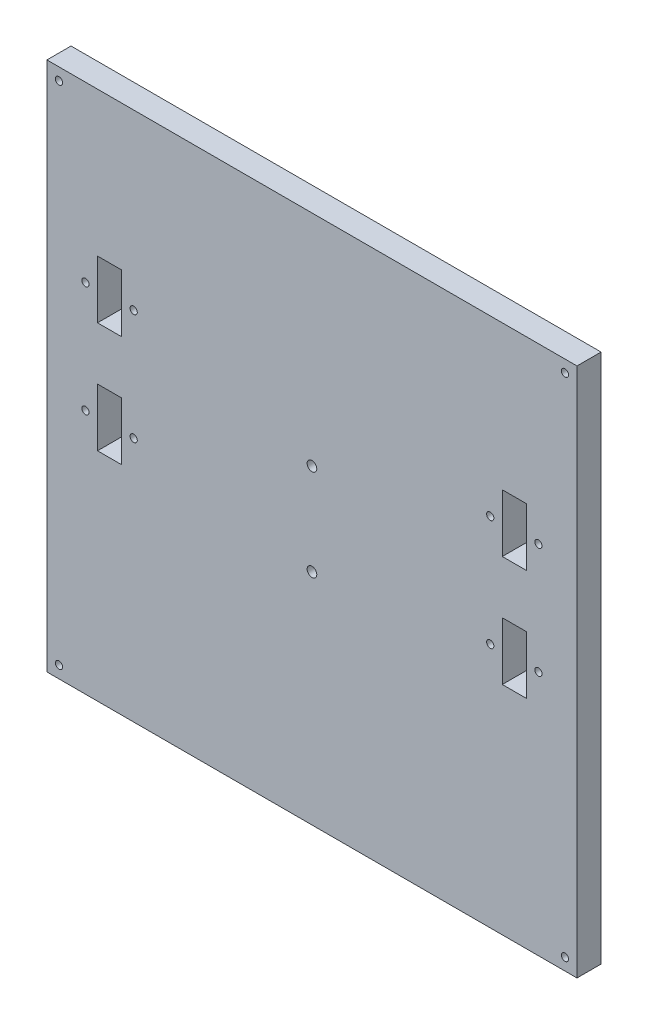
ISO-10303-21;
HEADER;
FILE_DESCRIPTION(('STEP AP214'),'2;1');
FILE_NAME('part.step','',(''),(''),'','','');
FILE_SCHEMA(('AUTOMOTIVE_DESIGN { 1 0 10303 214 1 1 1 1 }'));
ENDSEC;
DATA;
#1=APPLICATION_CONTEXT('core data for automotive mechanical design processes');
#2=APPLICATION_PROTOCOL_DEFINITION('international standard','automotive_design',2000,#1);
#3=PRODUCT_CONTEXT('',#1,'mechanical');
#4=PRODUCT('Part','Part','',(#3));
#5=PRODUCT_RELATED_PRODUCT_CATEGORY('part','',(#4));
#6=PRODUCT_DEFINITION_FORMATION('','',#4);
#7=PRODUCT_DEFINITION_CONTEXT('part definition',#1,'design');
#8=PRODUCT_DEFINITION('design','',#6,#7);
#9=PRODUCT_DEFINITION_SHAPE('','',#8);
#10=(LENGTH_UNIT() NAMED_UNIT(*) SI_UNIT(.MILLI.,.METRE.));
#11=(NAMED_UNIT(*) PLANE_ANGLE_UNIT() SI_UNIT($,.RADIAN.));
#12=(NAMED_UNIT(*) SI_UNIT($,.STERADIAN.) SOLID_ANGLE_UNIT());
#13=UNCERTAINTY_MEASURE_WITH_UNIT(LENGTH_MEASURE(1.E-05),#10,'distance_accuracy_value','');
#14=(GEOMETRIC_REPRESENTATION_CONTEXT(3) GLOBAL_UNCERTAINTY_ASSIGNED_CONTEXT((#13)) GLOBAL_UNIT_ASSIGNED_CONTEXT((#10,
#11,#12)) REPRESENTATION_CONTEXT('',''));
#15=CARTESIAN_POINT('',(0.,0.,0.));
#16=DIRECTION('',(0.,0.,1.));
#17=DIRECTION('',(1.,0.,0.));
#18=AXIS2_PLACEMENT_3D('',#15,#16,#17);
#19=CARTESIAN_POINT('',(112.522330276901,130.812483699006,10.));
#20=DIRECTION('',(1.,0.,0.));
#21=DIRECTION('',(0.,0.,-1.));
#22=AXIS2_PLACEMENT_3D('',#19,#20,#21);
#23=PLANE('',#22);
#24=DIRECTION('',(0.,-1.,0.));
#25=VECTOR('',#24,1.);
#26=CARTESIAN_POINT('',(112.522330276901,130.812483699006,0.));
#27=LINE('',#26,#25);
#28=CARTESIAN_POINT('',(112.522330276901,130.812483699006,0.));
#29=VERTEX_POINT('',#28);
#30=CARTESIAN_POINT('',(112.522330276901,-89.1875163009939,0.));
#31=VERTEX_POINT('',#30);
#32=EDGE_CURVE('E345',#29,#31,#27,.T.);
#33=ORIENTED_EDGE('',*,*,#32,.T.);
#34=DIRECTION('',(0.,0.,-1.));
#35=VECTOR('',#34,1.);
#36=CARTESIAN_POINT('',(112.522330276901,-89.1875163009939,10.));
#37=LINE('',#36,#35);
#38=CARTESIAN_POINT('',(112.522330276901,-89.1875163009939,10.));
#39=VERTEX_POINT('',#38);
#40=EDGE_CURVE('E11',#39,#31,#37,.T.);
#41=ORIENTED_EDGE('',*,*,#40,.F.);
#42=DIRECTION('',(0.,-1.,0.));
#43=VECTOR('',#42,1.);
#44=CARTESIAN_POINT('',(112.522330276901,130.812483699006,10.));
#45=LINE('',#44,#43);
#46=CARTESIAN_POINT('',(112.522330276901,130.812483699006,10.));
#47=VERTEX_POINT('',#46);
#48=EDGE_CURVE('E348',#47,#39,#45,.T.);
#49=ORIENTED_EDGE('',*,*,#48,.F.);
#50=DIRECTION('',(0.,0.,-1.));
#51=VECTOR('',#50,1.);
#52=CARTESIAN_POINT('',(112.522330276901,130.812483699006,10.));
#53=LINE('',#52,#51);
#54=EDGE_CURVE('E358',#47,#29,#53,.T.);
#55=ORIENTED_EDGE('',*,*,#54,.T.);
#56=EDGE_LOOP('',(#33,#41,#49,#55));
#57=FACE_BOUND('',#56,.T.);
#58=ADVANCED_FACE('F32',(#57),#23,.F.);
#59=CARTESIAN_POINT('',(112.522330276901,-89.1875163009939,10.));
#60=DIRECTION('',(0.,1.,0.));
#61=DIRECTION('',(0.,0.,1.));
#62=AXIS2_PLACEMENT_3D('',#59,#60,#61);
#63=PLANE('',#62);
#64=DIRECTION('',(1.,0.,0.));
#65=VECTOR('',#64,1.);
#66=CARTESIAN_POINT('',(112.522330276901,-89.1875163009939,0.));
#67=LINE('',#66,#65);
#68=CARTESIAN_POINT('',(332.522330276901,-89.1875163009939,0.));
#69=VERTEX_POINT('',#68);
#70=EDGE_CURVE('E361',#31,#69,#67,.T.);
#71=ORIENTED_EDGE('',*,*,#70,.T.);
#72=DIRECTION('',(0.,0.,-1.));
#73=VECTOR('',#72,1.);
#74=CARTESIAN_POINT('',(332.522330276901,-89.1875163009939,10.));
#75=LINE('',#74,#73);
#76=CARTESIAN_POINT('',(332.522330276901,-89.1875163009939,10.));
#77=VERTEX_POINT('',#76);
#78=EDGE_CURVE('E39',#77,#69,#75,.T.);
#79=ORIENTED_EDGE('',*,*,#78,.F.);
#80=DIRECTION('',(1.,0.,0.));
#81=VECTOR('',#80,1.);
#82=CARTESIAN_POINT('',(112.522330276901,-89.1875163009939,10.));
#83=LINE('',#82,#81);
#84=EDGE_CURVE('E351',#39,#77,#83,.T.);
#85=ORIENTED_EDGE('',*,*,#84,.F.);
#86=ORIENTED_EDGE('',*,*,#40,.T.);
#87=EDGE_LOOP('',(#71,#79,#85,#86));
#88=FACE_BOUND('',#87,.T.);
#89=ADVANCED_FACE('F390',(#88),#63,.F.);
#90=CARTESIAN_POINT('',(332.522330276901,130.812483699006,10.));
#91=DIRECTION('',(-1.,0.,0.));
#92=DIRECTION('',(0.,-1.,0.));
#93=AXIS2_PLACEMENT_3D('',#90,#91,#92);
#94=PLANE('',#93);
#95=DIRECTION('',(0.,1.,0.));
#96=VECTOR('',#95,1.);
#97=CARTESIAN_POINT('',(332.522330276901,130.812483699006,0.));
#98=LINE('',#97,#96);
#99=CARTESIAN_POINT('',(332.522330276901,130.812483699006,0.));
#100=VERTEX_POINT('',#99);
#101=EDGE_CURVE('E363',#69,#100,#98,.T.);
#102=ORIENTED_EDGE('',*,*,#101,.T.);
#103=DIRECTION('',(0.,0.,-1.));
#104=VECTOR('',#103,1.);
#105=CARTESIAN_POINT('',(332.522330276901,130.812483699006,10.));
#106=LINE('',#105,#104);
#107=CARTESIAN_POINT('',(332.522330276901,130.812483699006,10.));
#108=VERTEX_POINT('',#107);
#109=EDGE_CURVE('E368',#108,#100,#106,.T.);
#110=ORIENTED_EDGE('',*,*,#109,.F.);
#111=DIRECTION('',(0.,1.,0.));
#112=VECTOR('',#111,1.);
#113=CARTESIAN_POINT('',(332.522330276901,130.812483699006,10.));
#114=LINE('',#113,#112);
#115=EDGE_CURVE('E354',#77,#108,#114,.T.);
#116=ORIENTED_EDGE('',*,*,#115,.F.);
#117=ORIENTED_EDGE('',*,*,#78,.T.);
#118=EDGE_LOOP('',(#102,#110,#116,#117));
#119=FACE_BOUND('',#118,.T.);
#120=ADVANCED_FACE('F375',(#119),#94,.F.);
#121=CARTESIAN_POINT('',(112.522330276901,130.812483699006,10.));
#122=DIRECTION('',(0.,-1.,0.));
#123=DIRECTION('',(0.,0.,-1.));
#124=AXIS2_PLACEMENT_3D('',#121,#122,#123);
#125=PLANE('',#124);
#126=DIRECTION('',(-1.,0.,0.));
#127=VECTOR('',#126,1.);
#128=CARTESIAN_POINT('',(112.522330276901,130.812483699006,0.));
#129=LINE('',#128,#127);
#130=EDGE_CURVE('E352',#100,#29,#129,.T.);
#131=ORIENTED_EDGE('',*,*,#130,.T.);
#132=ORIENTED_EDGE('',*,*,#54,.F.);
#133=DIRECTION('',(-1.,0.,0.));
#134=VECTOR('',#133,1.);
#135=CARTESIAN_POINT('',(112.522330276901,130.812483699006,10.));
#136=LINE('',#135,#134);
#137=EDGE_CURVE('E356',#108,#47,#136,.T.);
#138=ORIENTED_EDGE('',*,*,#137,.F.);
#139=ORIENTED_EDGE('',*,*,#109,.T.);
#140=EDGE_LOOP('',(#131,#132,#138,#139));
#141=FACE_BOUND('',#140,.T.);
#142=ADVANCED_FACE('F383',(#141),#125,.F.);
#143=CARTESIAN_POINT('',(0.,0.,10.));
#144=DIRECTION('',(0.,0.,1.));
#145=DIRECTION('',(1.,0.,0.));
#146=AXIS2_PLACEMENT_3D('',#143,#144,#145);
#147=PLANE('',#146);
#148=CARTESIAN_POINT('',(222.522330276901,39.8124836990061,10.));
#149=DIRECTION('',(0.,0.,1.));
#150=DIRECTION('',(1.,0.,0.));
#151=AXIS2_PLACEMENT_3D('',#148,#149,#150);
#152=CIRCLE('',#151,2.);
#153=CARTESIAN_POINT('',(224.522330276901,39.8124836990061,10.));
#154=VERTEX_POINT('',#153);
#155=EDGE_CURVE('E528',#154,#154,#152,.T.);
#156=ORIENTED_EDGE('',*,*,#155,.F.);
#157=EDGE_LOOP('',(#156));
#158=FACE_BOUND('',#157,.T.);
#159=CARTESIAN_POINT('',(222.522330276901,1.81248369900609,10.));
#160=DIRECTION('',(0.,0.,1.));
#161=DIRECTION('',(1.,0.,0.));
#162=AXIS2_PLACEMENT_3D('',#159,#160,#161);
#163=CIRCLE('',#162,2.);
#164=CARTESIAN_POINT('',(224.522330276901,1.81248369900609,10.));
#165=VERTEX_POINT('',#164);
#166=EDGE_CURVE('E534',#165,#165,#163,.T.);
#167=ORIENTED_EDGE('',*,*,#166,.F.);
#168=EDGE_LOOP('',(#167));
#169=FACE_BOUND('',#168,.T.);
#170=DIRECTION('',(0.,-1.,0.));
#171=VECTOR('',#170,1.);
#172=CARTESIAN_POINT('',(301.522330276901,24.8124836990061,10.));
#173=LINE('',#172,#171);
#174=CARTESIAN_POINT('',(301.522330276901,24.8124836990061,10.));
#175=VERTEX_POINT('',#174);
#176=CARTESIAN_POINT('',(301.522330276901,0.812483699006078,10.));
#177=VERTEX_POINT('',#176);
#178=EDGE_CURVE('E46',#175,#177,#173,.T.);
#179=ORIENTED_EDGE('',*,*,#178,.F.);
#180=DIRECTION('',(-1.,0.,0.));
#181=VECTOR('',#180,1.);
#182=CARTESIAN_POINT('',(301.522330276901,24.8124836990061,10.));
#183=LINE('',#182,#181);
#184=CARTESIAN_POINT('',(311.522330276901,24.8124836990061,10.));
#185=VERTEX_POINT('',#184);
#186=EDGE_CURVE('E189',#185,#175,#183,.T.);
#187=ORIENTED_EDGE('',*,*,#186,.F.);
#188=DIRECTION('',(0.,1.,0.));
#189=VECTOR('',#188,1.);
#190=CARTESIAN_POINT('',(311.522330276901,24.8124836990061,10.));
#191=LINE('',#190,#189);
#192=CARTESIAN_POINT('',(311.522330276901,0.812483699006078,10.));
#193=VERTEX_POINT('',#192);
#194=EDGE_CURVE('E192',#193,#185,#191,.T.);
#195=ORIENTED_EDGE('',*,*,#194,.F.);
#196=DIRECTION('',(1.,0.,0.));
#197=VECTOR('',#196,1.);
#198=CARTESIAN_POINT('',(301.522330276901,0.812483699006078,10.));
#199=LINE('',#198,#197);
#200=EDGE_CURVE('E201',#177,#193,#199,.T.);
#201=ORIENTED_EDGE('',*,*,#200,.F.);
#202=EDGE_LOOP('',(#179,#187,#195,#201));
#203=FACE_BOUND('',#202,.T.);
#204=CARTESIAN_POINT('',(128.522330276901,12.8124836990061,10.));
#205=DIRECTION('',(0.,0.,1.));
#206=DIRECTION('',(1.,0.,0.));
#207=AXIS2_PLACEMENT_3D('',#204,#205,#206);
#208=CIRCLE('',#207,1.5);
#209=CARTESIAN_POINT('',(130.022330276901,12.8124836990061,10.));
#210=VERTEX_POINT('',#209);
#211=EDGE_CURVE('E214',#210,#210,#208,.T.);
#212=ORIENTED_EDGE('',*,*,#211,.F.);
#213=EDGE_LOOP('',(#212));
#214=FACE_BOUND('',#213,.T.);
#215=CARTESIAN_POINT('',(148.522330276901,12.8124836990061,10.));
#216=DIRECTION('',(0.,0.,1.));
#217=DIRECTION('',(1.,0.,0.));
#218=AXIS2_PLACEMENT_3D('',#215,#216,#217);
#219=CIRCLE('',#218,1.5);
#220=CARTESIAN_POINT('',(150.022330276901,12.8124836990061,10.));
#221=VERTEX_POINT('',#220);
#222=EDGE_CURVE('E558',#221,#221,#219,.T.);
#223=ORIENTED_EDGE('',*,*,#222,.F.);
#224=EDGE_LOOP('',(#223));
#225=FACE_BOUND('',#224,.T.);
#226=CARTESIAN_POINT('',(296.522330276901,12.8124836990061,10.));
#227=DIRECTION('',(0.,0.,1.));
#228=DIRECTION('',(1.,0.,0.));
#229=AXIS2_PLACEMENT_3D('',#226,#227,#228);
#230=CIRCLE('',#229,1.50000000000002);
#231=CARTESIAN_POINT('',(298.022330276901,12.8124836990061,10.));
#232=VERTEX_POINT('',#231);
#233=EDGE_CURVE('E195',#232,#232,#230,.T.);
#234=ORIENTED_EDGE('',*,*,#233,.F.);
#235=EDGE_LOOP('',(#234));
#236=FACE_BOUND('',#235,.T.);
#237=CARTESIAN_POINT('',(128.522330276901,58.8124836990061,10.));
#238=DIRECTION('',(0.,0.,1.));
#239=DIRECTION('',(1.,0.,0.));
#240=AXIS2_PLACEMENT_3D('',#237,#238,#239);
#241=CIRCLE('',#240,1.5);
#242=CARTESIAN_POINT('',(130.022330276901,58.8124836990061,10.));
#243=VERTEX_POINT('',#242);
#244=EDGE_CURVE('E284',#243,#243,#241,.T.);
#245=ORIENTED_EDGE('',*,*,#244,.F.);
#246=EDGE_LOOP('',(#245));
#247=FACE_BOUND('',#246,.T.);
#248=CARTESIAN_POINT('',(148.522330276901,58.8124836990061,10.));
#249=DIRECTION('',(0.,0.,1.));
#250=DIRECTION('',(1.,0.,0.));
#251=AXIS2_PLACEMENT_3D('',#248,#249,#250);
#252=CIRCLE('',#251,1.5);
#253=CARTESIAN_POINT('',(150.022330276901,58.8124836990061,10.));
#254=VERTEX_POINT('',#253);
#255=EDGE_CURVE('E244',#254,#254,#252,.T.);
#256=ORIENTED_EDGE('',*,*,#255,.F.);
#257=EDGE_LOOP('',(#256));
#258=FACE_BOUND('',#257,.T.);
#259=DIRECTION('',(0.,-1.,0.));
#260=VECTOR('',#259,1.);
#261=CARTESIAN_POINT('',(133.522330276901,24.8124836990061,10.));
#262=LINE('',#261,#260);
#263=CARTESIAN_POINT('',(133.522330276901,24.8124836990061,10.));
#264=VERTEX_POINT('',#263);
#265=CARTESIAN_POINT('',(133.522330276901,0.812483699006078,10.));
#266=VERTEX_POINT('',#265);
#267=EDGE_CURVE('E54',#264,#266,#262,.T.);
#268=ORIENTED_EDGE('',*,*,#267,.F.);
#269=DIRECTION('',(-1.,0.,0.));
#270=VECTOR('',#269,1.);
#271=CARTESIAN_POINT('',(133.522330276901,24.8124836990061,10.));
#272=LINE('',#271,#270);
#273=CARTESIAN_POINT('',(143.522330276901,24.8124836990061,10.));
#274=VERTEX_POINT('',#273);
#275=EDGE_CURVE('E222',#274,#264,#272,.T.);
#276=ORIENTED_EDGE('',*,*,#275,.F.);
#277=DIRECTION('',(0.,1.,0.));
#278=VECTOR('',#277,1.);
#279=CARTESIAN_POINT('',(143.522330276901,24.8124836990061,10.));
#280=LINE('',#279,#278);
#281=CARTESIAN_POINT('',(143.522330276901,0.812483699006078,10.));
#282=VERTEX_POINT('',#281);
#283=EDGE_CURVE('E237',#282,#274,#280,.T.);
#284=ORIENTED_EDGE('',*,*,#283,.F.);
#285=DIRECTION('',(1.,0.,0.));
#286=VECTOR('',#285,1.);
#287=CARTESIAN_POINT('',(133.522330276901,0.812483699006078,10.));
#288=LINE('',#287,#286);
#289=EDGE_CURVE('E233',#266,#282,#288,.T.);
#290=ORIENTED_EDGE('',*,*,#289,.F.);
#291=EDGE_LOOP('',(#268,#276,#284,#290));
#292=FACE_BOUND('',#291,.T.);
#293=DIRECTION('',(0.,-1.,0.));
#294=VECTOR('',#293,1.);
#295=CARTESIAN_POINT('',(301.522330276901,70.8124836990061,10.));
#296=LINE('',#295,#294);
#297=CARTESIAN_POINT('',(301.522330276901,70.8124836990061,10.));
#298=VERTEX_POINT('',#297);
#299=CARTESIAN_POINT('',(301.522330276901,46.8124836990061,10.));
#300=VERTEX_POINT('',#299);
#301=EDGE_CURVE('E208',#298,#300,#296,.T.);
#302=ORIENTED_EDGE('',*,*,#301,.F.);
#303=DIRECTION('',(-1.,0.,0.));
#304=VECTOR('',#303,1.);
#305=CARTESIAN_POINT('',(301.522330276901,70.8124836990061,10.));
#306=LINE('',#305,#304);
#307=CARTESIAN_POINT('',(311.522330276901,70.8124836990061,10.));
#308=VERTEX_POINT('',#307);
#309=EDGE_CURVE('E254',#308,#298,#306,.T.);
#310=ORIENTED_EDGE('',*,*,#309,.F.);
#311=DIRECTION('',(0.,1.,0.));
#312=VECTOR('',#311,1.);
#313=CARTESIAN_POINT('',(311.522330276901,70.8124836990061,10.));
#314=LINE('',#313,#312);
#315=CARTESIAN_POINT('',(311.522330276901,46.8124836990061,10.));
#316=VERTEX_POINT('',#315);
#317=EDGE_CURVE('E268',#316,#308,#314,.T.);
#318=ORIENTED_EDGE('',*,*,#317,.F.);
#319=DIRECTION('',(1.,0.,0.));
#320=VECTOR('',#319,1.);
#321=CARTESIAN_POINT('',(301.522330276901,46.8124836990061,10.));
#322=LINE('',#321,#320);
#323=EDGE_CURVE('E265',#300,#316,#322,.T.);
#324=ORIENTED_EDGE('',*,*,#323,.F.);
#325=EDGE_LOOP('',(#302,#310,#318,#324));
#326=FACE_BOUND('',#325,.T.);
#327=CARTESIAN_POINT('',(316.522330276901,58.8124836990061,10.));
#328=DIRECTION('',(0.,0.,1.));
#329=DIRECTION('',(1.,0.,0.));
#330=AXIS2_PLACEMENT_3D('',#327,#328,#329);
#331=CIRCLE('',#330,1.50000000000002);
#332=CARTESIAN_POINT('',(318.022330276901,58.8124836990061,10.));
#333=VERTEX_POINT('',#332);
#334=EDGE_CURVE('E531',#333,#333,#331,.T.);
#335=ORIENTED_EDGE('',*,*,#334,.F.);
#336=EDGE_LOOP('',(#335));
#337=FACE_BOUND('',#336,.T.);
#338=CARTESIAN_POINT('',(296.522330276901,58.8124836990061,10.));
#339=DIRECTION('',(0.,0.,1.));
#340=DIRECTION('',(1.,0.,0.));
#341=AXIS2_PLACEMENT_3D('',#338,#339,#340);
#342=CIRCLE('',#341,1.50000000000002);
#343=CARTESIAN_POINT('',(298.022330276901,58.8124836990061,10.));
#344=VERTEX_POINT('',#343);
#345=EDGE_CURVE('E542',#344,#344,#342,.T.);
#346=ORIENTED_EDGE('',*,*,#345,.F.);
#347=EDGE_LOOP('',(#346));
#348=FACE_BOUND('',#347,.T.);
#349=CARTESIAN_POINT('',(316.522330276901,12.8124836990061,10.));
#350=DIRECTION('',(0.,0.,1.));
#351=DIRECTION('',(1.,0.,0.));
#352=AXIS2_PLACEMENT_3D('',#349,#350,#351);
#353=CIRCLE('',#352,1.50000000000002);
#354=CARTESIAN_POINT('',(318.022330276901,12.8124836990061,10.));
#355=VERTEX_POINT('',#354);
#356=EDGE_CURVE('E548',#355,#355,#353,.T.);
#357=ORIENTED_EDGE('',*,*,#356,.F.);
#358=EDGE_LOOP('',(#357));
#359=FACE_BOUND('',#358,.T.);
#360=DIRECTION('',(0.,-1.,0.));
#361=VECTOR('',#360,1.);
#362=CARTESIAN_POINT('',(133.522330276901,70.8124836990061,10.));
#363=LINE('',#362,#361);
#364=CARTESIAN_POINT('',(133.522330276901,70.8124836990061,10.));
#365=VERTEX_POINT('',#364);
#366=CARTESIAN_POINT('',(133.522330276901,46.8124836990061,10.));
#367=VERTEX_POINT('',#366);
#368=EDGE_CURVE('E283',#365,#367,#363,.T.);
#369=ORIENTED_EDGE('',*,*,#368,.F.);
#370=DIRECTION('',(-1.,0.,0.));
#371=VECTOR('',#370,1.);
#372=CARTESIAN_POINT('',(133.522330276901,70.8124836990061,10.));
#373=LINE('',#372,#371);
#374=CARTESIAN_POINT('',(143.522330276901,70.8124836990061,10.));
#375=VERTEX_POINT('',#374);
#376=EDGE_CURVE('E296',#375,#365,#373,.T.);
#377=ORIENTED_EDGE('',*,*,#376,.F.);
#378=DIRECTION('',(0.,1.,0.));
#379=VECTOR('',#378,1.);
#380=CARTESIAN_POINT('',(143.522330276901,70.8124836990061,10.));
#381=LINE('',#380,#379);
#382=CARTESIAN_POINT('',(143.522330276901,46.8124836990061,10.));
#383=VERTEX_POINT('',#382);
#384=EDGE_CURVE('E310',#383,#375,#381,.T.);
#385=ORIENTED_EDGE('',*,*,#384,.F.);
#386=DIRECTION('',(1.,0.,0.));
#387=VECTOR('',#386,1.);
#388=CARTESIAN_POINT('',(133.522330276901,46.8124836990061,10.));
#389=LINE('',#388,#387);
#390=EDGE_CURVE('E307',#367,#383,#389,.T.);
#391=ORIENTED_EDGE('',*,*,#390,.F.);
#392=EDGE_LOOP('',(#369,#377,#385,#391));
#393=FACE_BOUND('',#392,.T.);
#394=CARTESIAN_POINT('',(327.522330276901,125.812483699006,10.));
#395=DIRECTION('',(0.,0.,1.));
#396=DIRECTION('',(1.,0.,0.));
#397=AXIS2_PLACEMENT_3D('',#394,#395,#396);
#398=CIRCLE('',#397,1.50000000000002);
#399=CARTESIAN_POINT('',(329.022330276901,125.812483699006,10.));
#400=VERTEX_POINT('',#399);
#401=EDGE_CURVE('E317',#400,#400,#398,.T.);
#402=ORIENTED_EDGE('',*,*,#401,.F.);
#403=EDGE_LOOP('',(#402));
#404=FACE_BOUND('',#403,.T.);
#405=CARTESIAN_POINT('',(327.522330276901,-84.1875163009939,10.));
#406=DIRECTION('',(0.,0.,1.));
#407=DIRECTION('',(1.,0.,0.));
#408=AXIS2_PLACEMENT_3D('',#405,#406,#407);
#409=CIRCLE('',#408,1.50000000000002);
#410=CARTESIAN_POINT('',(329.022330276901,-84.1875163009939,10.));
#411=VERTEX_POINT('',#410);
#412=EDGE_CURVE('E334',#411,#411,#409,.T.);
#413=ORIENTED_EDGE('',*,*,#412,.F.);
#414=EDGE_LOOP('',(#413));
#415=FACE_BOUND('',#414,.T.);
#416=CARTESIAN_POINT('',(117.522330276901,-84.1875163009939,10.));
#417=DIRECTION('',(0.,0.,1.));
#418=DIRECTION('',(1.,0.,0.));
#419=AXIS2_PLACEMENT_3D('',#416,#417,#418);
#420=CIRCLE('',#419,1.5);
#421=CARTESIAN_POINT('',(119.022330276901,-84.1875163009939,10.));
#422=VERTEX_POINT('',#421);
#423=EDGE_CURVE('E328',#422,#422,#420,.T.);
#424=ORIENTED_EDGE('',*,*,#423,.F.);
#425=EDGE_LOOP('',(#424));
#426=FACE_BOUND('',#425,.T.);
#427=CARTESIAN_POINT('',(117.522330276901,125.812483699006,10.));
#428=DIRECTION('',(0.,0.,1.));
#429=DIRECTION('',(1.,0.,0.));
#430=AXIS2_PLACEMENT_3D('',#427,#428,#429);
#431=CIRCLE('',#430,1.49999999999997);
#432=CARTESIAN_POINT('',(119.022330276901,125.812483699006,10.));
#433=VERTEX_POINT('',#432);
#434=EDGE_CURVE('E327',#433,#433,#431,.T.);
#435=ORIENTED_EDGE('',*,*,#434,.F.);
#436=EDGE_LOOP('',(#435));
#437=FACE_BOUND('',#436,.T.);
#438=ORIENTED_EDGE('',*,*,#48,.T.);
#439=ORIENTED_EDGE('',*,*,#84,.T.);
#440=ORIENTED_EDGE('',*,*,#115,.T.);
#441=ORIENTED_EDGE('',*,*,#137,.T.);
#442=EDGE_LOOP('',(#438,#439,#440,#441));
#443=FACE_BOUND('',#442,.T.);
#444=ADVANCED_FACE('F389',(#158,#169,#203,#214,#225,#236,#247,#258,#292,#326,#337,#348,#359,
#393,#404,#415,#426,#437,#443),#147,.T.);
#445=CARTESIAN_POINT('',(0.,0.,0.));
#446=DIRECTION('',(0.,0.,1.));
#447=DIRECTION('',(1.,0.,0.));
#448=AXIS2_PLACEMENT_3D('',#445,#446,#447);
#449=PLANE('',#448);
#450=CARTESIAN_POINT('',(222.522330276901,39.8124836990061,0.));
#451=DIRECTION('',(0.,0.,1.));
#452=DIRECTION('',(1.,0.,0.));
#453=AXIS2_PLACEMENT_3D('',#450,#451,#452);
#454=CIRCLE('',#453,2.);
#455=CARTESIAN_POINT('',(224.522330276901,39.8124836990061,0.));
#456=VERTEX_POINT('',#455);
#457=EDGE_CURVE('E525',#456,#456,#454,.T.);
#458=ORIENTED_EDGE('',*,*,#457,.T.);
#459=EDGE_LOOP('',(#458));
#460=FACE_BOUND('',#459,.T.);
#461=CARTESIAN_POINT('',(222.522330276901,1.81248369900609,0.));
#462=DIRECTION('',(0.,0.,1.));
#463=DIRECTION('',(1.,0.,0.));
#464=AXIS2_PLACEMENT_3D('',#461,#462,#463);
#465=CIRCLE('',#464,2.);
#466=CARTESIAN_POINT('',(224.522330276901,1.81248369900609,0.));
#467=VERTEX_POINT('',#466);
#468=EDGE_CURVE('E529',#467,#467,#465,.T.);
#469=ORIENTED_EDGE('',*,*,#468,.T.);
#470=EDGE_LOOP('',(#469));
#471=FACE_BOUND('',#470,.T.);
#472=DIRECTION('',(-1.,0.,0.));
#473=VECTOR('',#472,1.);
#474=CARTESIAN_POINT('',(301.522330276901,24.8124836990061,0.));
#475=LINE('',#474,#473);
#476=CARTESIAN_POINT('',(311.522330276901,24.8124836990061,0.));
#477=VERTEX_POINT('',#476);
#478=CARTESIAN_POINT('',(301.522330276901,24.8124836990061,0.));
#479=VERTEX_POINT('',#478);
#480=EDGE_CURVE('E176',#477,#479,#475,.T.);
#481=ORIENTED_EDGE('',*,*,#480,.T.);
#482=DIRECTION('',(0.,-1.,0.));
#483=VECTOR('',#482,1.);
#484=CARTESIAN_POINT('',(301.522330276901,24.8124836990061,0.));
#485=LINE('',#484,#483);
#486=CARTESIAN_POINT('',(301.522330276901,0.812483699006078,0.));
#487=VERTEX_POINT('',#486);
#488=EDGE_CURVE('E170',#479,#487,#485,.T.);
#489=ORIENTED_EDGE('',*,*,#488,.T.);
#490=DIRECTION('',(1.,0.,0.));
#491=VECTOR('',#490,1.);
#492=CARTESIAN_POINT('',(301.522330276901,0.812483699006078,0.));
#493=LINE('',#492,#491);
#494=CARTESIAN_POINT('',(311.522330276901,0.812483699006078,0.));
#495=VERTEX_POINT('',#494);
#496=EDGE_CURVE('E180',#487,#495,#493,.T.);
#497=ORIENTED_EDGE('',*,*,#496,.T.);
#498=DIRECTION('',(0.,1.,0.));
#499=VECTOR('',#498,1.);
#500=CARTESIAN_POINT('',(311.522330276901,24.8124836990061,0.));
#501=LINE('',#500,#499);
#502=EDGE_CURVE('E184',#495,#477,#501,.T.);
#503=ORIENTED_EDGE('',*,*,#502,.T.);
#504=EDGE_LOOP('',(#481,#489,#497,#503));
#505=FACE_BOUND('',#504,.T.);
#506=CARTESIAN_POINT('',(128.522330276901,12.8124836990061,0.));
#507=DIRECTION('',(0.,0.,1.));
#508=DIRECTION('',(1.,0.,0.));
#509=AXIS2_PLACEMENT_3D('',#506,#507,#508);
#510=CIRCLE('',#509,1.5);
#511=CARTESIAN_POINT('',(130.022330276901,12.8124836990061,0.));
#512=VERTEX_POINT('',#511);
#513=EDGE_CURVE('E202',#512,#512,#510,.T.);
#514=ORIENTED_EDGE('',*,*,#513,.T.);
#515=EDGE_LOOP('',(#514));
#516=FACE_BOUND('',#515,.T.);
#517=CARTESIAN_POINT('',(148.522330276901,12.8124836990061,0.));
#518=DIRECTION('',(0.,0.,1.));
#519=DIRECTION('',(1.,0.,0.));
#520=AXIS2_PLACEMENT_3D('',#517,#518,#519);
#521=CIRCLE('',#520,1.5);
#522=CARTESIAN_POINT('',(150.022330276901,12.8124836990061,0.));
#523=VERTEX_POINT('',#522);
#524=EDGE_CURVE('E217',#523,#523,#521,.T.);
#525=ORIENTED_EDGE('',*,*,#524,.T.);
#526=EDGE_LOOP('',(#525));
#527=FACE_BOUND('',#526,.T.);
#528=CARTESIAN_POINT('',(296.522330276901,12.8124836990061,0.));
#529=DIRECTION('',(0.,0.,1.));
#530=DIRECTION('',(1.,0.,0.));
#531=AXIS2_PLACEMENT_3D('',#528,#529,#530);
#532=CIRCLE('',#531,1.50000000000002);
#533=CARTESIAN_POINT('',(298.022330276901,12.8124836990061,0.));
#534=VERTEX_POINT('',#533);
#535=EDGE_CURVE('E560',#534,#534,#532,.T.);
#536=ORIENTED_EDGE('',*,*,#535,.T.);
#537=EDGE_LOOP('',(#536));
#538=FACE_BOUND('',#537,.T.);
#539=CARTESIAN_POINT('',(128.522330276901,58.8124836990061,0.));
#540=DIRECTION('',(0.,0.,1.));
#541=DIRECTION('',(1.,0.,0.));
#542=AXIS2_PLACEMENT_3D('',#539,#540,#541);
#543=CIRCLE('',#542,1.5);
#544=CARTESIAN_POINT('',(130.022330276901,58.8124836990061,0.));
#545=VERTEX_POINT('',#544);
#546=EDGE_CURVE('E280',#545,#545,#543,.T.);
#547=ORIENTED_EDGE('',*,*,#546,.T.);
#548=EDGE_LOOP('',(#547));
#549=FACE_BOUND('',#548,.T.);
#550=CARTESIAN_POINT('',(148.522330276901,58.8124836990061,0.));
#551=DIRECTION('',(0.,0.,1.));
#552=DIRECTION('',(1.,0.,0.));
#553=AXIS2_PLACEMENT_3D('',#550,#551,#552);
#554=CIRCLE('',#553,1.5);
#555=CARTESIAN_POINT('',(150.022330276901,58.8124836990061,0.));
#556=VERTEX_POINT('',#555);
#557=EDGE_CURVE('E287',#556,#556,#554,.T.);
#558=ORIENTED_EDGE('',*,*,#557,.T.);
#559=EDGE_LOOP('',(#558));
#560=FACE_BOUND('',#559,.T.);
#561=DIRECTION('',(-1.,0.,0.));
#562=VECTOR('',#561,1.);
#563=CARTESIAN_POINT('',(133.522330276901,24.8124836990061,0.));
#564=LINE('',#563,#562);
#565=CARTESIAN_POINT('',(143.522330276901,24.8124836990061,0.));
#566=VERTEX_POINT('',#565);
#567=CARTESIAN_POINT('',(133.522330276901,24.8124836990061,0.));
#568=VERTEX_POINT('',#567);
#569=EDGE_CURVE('E228',#566,#568,#564,.T.);
#570=ORIENTED_EDGE('',*,*,#569,.T.);
#571=DIRECTION('',(0.,-1.,0.));
#572=VECTOR('',#571,1.);
#573=CARTESIAN_POINT('',(133.522330276901,24.8124836990061,0.));
#574=LINE('',#573,#572);
#575=CARTESIAN_POINT('',(133.522330276901,0.812483699006078,0.));
#576=VERTEX_POINT('',#575);
#577=EDGE_CURVE('E218',#568,#576,#574,.T.);
#578=ORIENTED_EDGE('',*,*,#577,.T.);
#579=DIRECTION('',(1.,0.,0.));
#580=VECTOR('',#579,1.);
#581=CARTESIAN_POINT('',(133.522330276901,0.812483699006078,0.));
#582=LINE('',#581,#580);
#583=CARTESIAN_POINT('',(143.522330276901,0.812483699006078,0.));
#584=VERTEX_POINT('',#583);
#585=EDGE_CURVE('E221',#576,#584,#582,.T.);
#586=ORIENTED_EDGE('',*,*,#585,.T.);
#587=DIRECTION('',(0.,1.,0.));
#588=VECTOR('',#587,1.);
#589=CARTESIAN_POINT('',(143.522330276901,24.8124836990061,0.));
#590=LINE('',#589,#588);
#591=EDGE_CURVE('E225',#584,#566,#590,.T.);
#592=ORIENTED_EDGE('',*,*,#591,.T.);
#593=EDGE_LOOP('',(#570,#578,#586,#592));
#594=FACE_BOUND('',#593,.T.);
#595=DIRECTION('',(-1.,0.,0.));
#596=VECTOR('',#595,1.);
#597=CARTESIAN_POINT('',(301.522330276901,70.8124836990061,0.));
#598=LINE('',#597,#596);
#599=CARTESIAN_POINT('',(311.522330276901,70.8124836990061,0.));
#600=VERTEX_POINT('',#599);
#601=CARTESIAN_POINT('',(301.522330276901,70.8124836990061,0.));
#602=VERTEX_POINT('',#601);
#603=EDGE_CURVE('E260',#600,#602,#598,.T.);
#604=ORIENTED_EDGE('',*,*,#603,.T.);
#605=DIRECTION('',(0.,-1.,0.));
#606=VECTOR('',#605,1.);
#607=CARTESIAN_POINT('',(301.522330276901,70.8124836990061,0.));
#608=LINE('',#607,#606);
#609=CARTESIAN_POINT('',(301.522330276901,46.8124836990061,0.));
#610=VERTEX_POINT('',#609);
#611=EDGE_CURVE('E250',#602,#610,#608,.T.);
#612=ORIENTED_EDGE('',*,*,#611,.T.);
#613=DIRECTION('',(1.,0.,0.));
#614=VECTOR('',#613,1.);
#615=CARTESIAN_POINT('',(301.522330276901,46.8124836990061,0.));
#616=LINE('',#615,#614);
#617=CARTESIAN_POINT('',(311.522330276901,46.8124836990061,0.));
#618=VERTEX_POINT('',#617);
#619=EDGE_CURVE('E253',#610,#618,#616,.T.);
#620=ORIENTED_EDGE('',*,*,#619,.T.);
#621=DIRECTION('',(0.,1.,0.));
#622=VECTOR('',#621,1.);
#623=CARTESIAN_POINT('',(311.522330276901,70.8124836990061,0.));
#624=LINE('',#623,#622);
#625=EDGE_CURVE('E257',#618,#600,#624,.T.);
#626=ORIENTED_EDGE('',*,*,#625,.T.);
#627=EDGE_LOOP('',(#604,#612,#620,#626));
#628=FACE_BOUND('',#627,.T.);
#629=CARTESIAN_POINT('',(316.522330276901,58.8124836990061,0.));
#630=DIRECTION('',(0.,0.,1.));
#631=DIRECTION('',(1.,0.,0.));
#632=AXIS2_PLACEMENT_3D('',#629,#630,#631);
#633=CIRCLE('',#632,1.50000000000002);
#634=CARTESIAN_POINT('',(318.022330276901,58.8124836990061,0.));
#635=VERTEX_POINT('',#634);
#636=EDGE_CURVE('E539',#635,#635,#633,.T.);
#637=ORIENTED_EDGE('',*,*,#636,.T.);
#638=EDGE_LOOP('',(#637));
#639=FACE_BOUND('',#638,.T.);
#640=CARTESIAN_POINT('',(296.522330276901,58.8124836990061,0.));
#641=DIRECTION('',(0.,0.,1.));
#642=DIRECTION('',(1.,0.,0.));
#643=AXIS2_PLACEMENT_3D('',#640,#641,#642);
#644=CIRCLE('',#643,1.50000000000002);
#645=CARTESIAN_POINT('',(298.022330276901,58.8124836990061,0.));
#646=VERTEX_POINT('',#645);
#647=EDGE_CURVE('E551',#646,#646,#644,.T.);
#648=ORIENTED_EDGE('',*,*,#647,.T.);
#649=EDGE_LOOP('',(#648));
#650=FACE_BOUND('',#649,.T.);
#651=CARTESIAN_POINT('',(316.522330276901,12.8124836990061,0.));
#652=DIRECTION('',(0.,0.,1.));
#653=DIRECTION('',(1.,0.,0.));
#654=AXIS2_PLACEMENT_3D('',#651,#652,#653);
#655=CIRCLE('',#654,1.50000000000002);
#656=CARTESIAN_POINT('',(318.022330276901,12.8124836990061,0.));
#657=VERTEX_POINT('',#656);
#658=EDGE_CURVE('E545',#657,#657,#655,.T.);
#659=ORIENTED_EDGE('',*,*,#658,.T.);
#660=EDGE_LOOP('',(#659));
#661=FACE_BOUND('',#660,.T.);
#662=DIRECTION('',(-1.,0.,0.));
#663=VECTOR('',#662,1.);
#664=CARTESIAN_POINT('',(133.522330276901,70.8124836990061,0.));
#665=LINE('',#664,#663);
#666=CARTESIAN_POINT('',(143.522330276901,70.8124836990061,0.));
#667=VERTEX_POINT('',#666);
#668=CARTESIAN_POINT('',(133.522330276901,70.8124836990061,0.));
#669=VERTEX_POINT('',#668);
#670=EDGE_CURVE('E302',#667,#669,#665,.T.);
#671=ORIENTED_EDGE('',*,*,#670,.T.);
#672=DIRECTION('',(0.,-1.,0.));
#673=VECTOR('',#672,1.);
#674=CARTESIAN_POINT('',(133.522330276901,70.8124836990061,0.));
#675=LINE('',#674,#673);
#676=CARTESIAN_POINT('',(133.522330276901,46.8124836990061,0.));
#677=VERTEX_POINT('',#676);
#678=EDGE_CURVE('E292',#669,#677,#675,.T.);
#679=ORIENTED_EDGE('',*,*,#678,.T.);
#680=DIRECTION('',(1.,0.,0.));
#681=VECTOR('',#680,1.);
#682=CARTESIAN_POINT('',(133.522330276901,46.8124836990061,0.));
#683=LINE('',#682,#681);
#684=CARTESIAN_POINT('',(143.522330276901,46.8124836990061,0.));
#685=VERTEX_POINT('',#684);
#686=EDGE_CURVE('E295',#677,#685,#683,.T.);
#687=ORIENTED_EDGE('',*,*,#686,.T.);
#688=DIRECTION('',(0.,1.,0.));
#689=VECTOR('',#688,1.);
#690=CARTESIAN_POINT('',(143.522330276901,70.8124836990061,0.));
#691=LINE('',#690,#689);
#692=EDGE_CURVE('E299',#685,#667,#691,.T.);
#693=ORIENTED_EDGE('',*,*,#692,.T.);
#694=EDGE_LOOP('',(#671,#679,#687,#693));
#695=FACE_BOUND('',#694,.T.);
#696=CARTESIAN_POINT('',(327.522330276901,125.812483699006,0.));
#697=DIRECTION('',(0.,0.,1.));
#698=DIRECTION('',(1.,0.,0.));
#699=AXIS2_PLACEMENT_3D('',#696,#697,#698);
#700=CIRCLE('',#699,1.50000000000002);
#701=CARTESIAN_POINT('',(329.022330276901,125.812483699006,0.));
#702=VERTEX_POINT('',#701);
#703=EDGE_CURVE('E337',#702,#702,#700,.T.);
#704=ORIENTED_EDGE('',*,*,#703,.T.);
#705=EDGE_LOOP('',(#704));
#706=FACE_BOUND('',#705,.T.);
#707=CARTESIAN_POINT('',(327.522330276901,-84.1875163009939,0.));
#708=DIRECTION('',(0.,0.,1.));
#709=DIRECTION('',(1.,0.,0.));
#710=AXIS2_PLACEMENT_3D('',#707,#708,#709);
#711=CIRCLE('',#710,1.50000000000002);
#712=CARTESIAN_POINT('',(329.022330276901,-84.1875163009939,0.));
#713=VERTEX_POINT('',#712);
#714=EDGE_CURVE('E331',#713,#713,#711,.T.);
#715=ORIENTED_EDGE('',*,*,#714,.T.);
#716=EDGE_LOOP('',(#715));
#717=FACE_BOUND('',#716,.T.);
#718=CARTESIAN_POINT('',(117.522330276901,-84.1875163009939,0.));
#719=DIRECTION('',(0.,0.,1.));
#720=DIRECTION('',(1.,0.,0.));
#721=AXIS2_PLACEMENT_3D('',#718,#719,#720);
#722=CIRCLE('',#721,1.5);
#723=CARTESIAN_POINT('',(119.022330276901,-84.1875163009939,0.));
#724=VERTEX_POINT('',#723);
#725=EDGE_CURVE('E324',#724,#724,#722,.T.);
#726=ORIENTED_EDGE('',*,*,#725,.T.);
#727=EDGE_LOOP('',(#726));
#728=FACE_BOUND('',#727,.T.);
#729=CARTESIAN_POINT('',(117.522330276901,125.812483699006,0.));
#730=DIRECTION('',(0.,0.,1.));
#731=DIRECTION('',(1.,0.,0.));
#732=AXIS2_PLACEMENT_3D('',#729,#730,#731);
#733=CIRCLE('',#732,1.49999999999997);
#734=CARTESIAN_POINT('',(119.022330276901,125.812483699006,0.));
#735=VERTEX_POINT('',#734);
#736=EDGE_CURVE('E342',#735,#735,#733,.T.);
#737=ORIENTED_EDGE('',*,*,#736,.T.);
#738=EDGE_LOOP('',(#737));
#739=FACE_BOUND('',#738,.T.);
#740=ORIENTED_EDGE('',*,*,#32,.F.);
#741=ORIENTED_EDGE('',*,*,#130,.F.);
#742=ORIENTED_EDGE('',*,*,#101,.F.);
#743=ORIENTED_EDGE('',*,*,#70,.F.);
#744=EDGE_LOOP('',(#740,#741,#742,#743));
#745=FACE_BOUND('',#744,.T.);
#746=ADVANCED_FACE('F186',(#460,#471,#505,#516,#527,#538,#549,#560,#594,#628,#639,#650,#661,
#695,#706,#717,#728,#739,#745),#449,.F.);
#747=CARTESIAN_POINT('',(117.522330276901,125.812483699006,0.));
#748=DIRECTION('',(0.,0.,1.));
#749=DIRECTION('',(1.,0.,0.));
#750=AXIS2_PLACEMENT_3D('',#747,#748,#749);
#751=CYLINDRICAL_SURFACE('',#750,1.49999999999997);
#752=ORIENTED_EDGE('',*,*,#736,.F.);
#753=EDGE_LOOP('',(#752));
#754=FACE_BOUND('',#753,.T.);
#755=ORIENTED_EDGE('',*,*,#434,.T.);
#756=EDGE_LOOP('',(#755));
#757=FACE_BOUND('',#756,.T.);
#758=ADVANCED_FACE('F402',(#754,#757),#751,.F.);
#759=CARTESIAN_POINT('',(117.522330276901,-84.1875163009939,0.));
#760=DIRECTION('',(0.,0.,1.));
#761=DIRECTION('',(1.,0.,0.));
#762=AXIS2_PLACEMENT_3D('',#759,#760,#761);
#763=CYLINDRICAL_SURFACE('',#762,1.5);
#764=ORIENTED_EDGE('',*,*,#725,.F.);
#765=EDGE_LOOP('',(#764));
#766=FACE_BOUND('',#765,.T.);
#767=ORIENTED_EDGE('',*,*,#423,.T.);
#768=EDGE_LOOP('',(#767));
#769=FACE_BOUND('',#768,.T.);
#770=ADVANCED_FACE('F409',(#766,#769),#763,.F.);
#771=CARTESIAN_POINT('',(327.522330276901,-84.1875163009939,0.));
#772=DIRECTION('',(0.,0.,1.));
#773=DIRECTION('',(1.,0.,0.));
#774=AXIS2_PLACEMENT_3D('',#771,#772,#773);
#775=CYLINDRICAL_SURFACE('',#774,1.50000000000002);
#776=ORIENTED_EDGE('',*,*,#714,.F.);
#777=EDGE_LOOP('',(#776));
#778=FACE_BOUND('',#777,.T.);
#779=ORIENTED_EDGE('',*,*,#412,.T.);
#780=EDGE_LOOP('',(#779));
#781=FACE_BOUND('',#780,.T.);
#782=ADVANCED_FACE('F415',(#778,#781),#775,.F.);
#783=CARTESIAN_POINT('',(327.522330276901,125.812483699006,0.));
#784=DIRECTION('',(0.,0.,1.));
#785=DIRECTION('',(1.,0.,0.));
#786=AXIS2_PLACEMENT_3D('',#783,#784,#785);
#787=CYLINDRICAL_SURFACE('',#786,1.50000000000002);
#788=ORIENTED_EDGE('',*,*,#703,.F.);
#789=EDGE_LOOP('',(#788));
#790=FACE_BOUND('',#789,.T.);
#791=ORIENTED_EDGE('',*,*,#401,.T.);
#792=EDGE_LOOP('',(#791));
#793=FACE_BOUND('',#792,.T.);
#794=ADVANCED_FACE('F411',(#790,#793),#787,.F.);
#795=CARTESIAN_POINT('',(133.522330276901,70.8124836990061,0.));
#796=DIRECTION('',(-1.,0.,0.));
#797=DIRECTION('',(0.,0.,1.));
#798=AXIS2_PLACEMENT_3D('',#795,#796,#797);
#799=PLANE('',#798);
#800=ORIENTED_EDGE('',*,*,#368,.T.);
#801=DIRECTION('',(0.,0.,1.));
#802=VECTOR('',#801,1.);
#803=CARTESIAN_POINT('',(133.522330276901,46.8124836990061,0.));
#804=LINE('',#803,#802);
#805=EDGE_CURVE('E305',#677,#367,#804,.T.);
#806=ORIENTED_EDGE('',*,*,#805,.F.);
#807=ORIENTED_EDGE('',*,*,#678,.F.);
#808=DIRECTION('',(0.,0.,1.));
#809=VECTOR('',#808,1.);
#810=CARTESIAN_POINT('',(133.522330276901,70.8124836990061,0.));
#811=LINE('',#810,#809);
#812=EDGE_CURVE('E315',#669,#365,#811,.T.);
#813=ORIENTED_EDGE('',*,*,#812,.T.);
#814=EDGE_LOOP('',(#800,#806,#807,#813));
#815=FACE_BOUND('',#814,.T.);
#816=ADVANCED_FACE('F414',(#815),#799,.F.);
#817=CARTESIAN_POINT('',(133.522330276901,70.8124836990061,0.));
#818=DIRECTION('',(0.,1.,0.));
#819=DIRECTION('',(-1.,0.,0.));
#820=AXIS2_PLACEMENT_3D('',#817,#818,#819);
#821=PLANE('',#820);
#822=ORIENTED_EDGE('',*,*,#376,.T.);
#823=ORIENTED_EDGE('',*,*,#812,.F.);
#824=ORIENTED_EDGE('',*,*,#670,.F.);
#825=DIRECTION('',(0.,0.,1.));
#826=VECTOR('',#825,1.);
#827=CARTESIAN_POINT('',(143.522330276901,70.8124836990061,0.));
#828=LINE('',#827,#826);
#829=EDGE_CURVE('E318',#667,#375,#828,.T.);
#830=ORIENTED_EDGE('',*,*,#829,.T.);
#831=EDGE_LOOP('',(#822,#823,#824,#830));
#832=FACE_BOUND('',#831,.T.);
#833=ADVANCED_FACE('F425',(#832),#821,.F.);
#834=CARTESIAN_POINT('',(143.522330276901,70.8124836990061,0.));
#835=DIRECTION('',(1.,0.,0.));
#836=DIRECTION('',(0.,0.,-1.));
#837=AXIS2_PLACEMENT_3D('',#834,#835,#836);
#838=PLANE('',#837);
#839=ORIENTED_EDGE('',*,*,#384,.T.);
#840=ORIENTED_EDGE('',*,*,#829,.F.);
#841=ORIENTED_EDGE('',*,*,#692,.F.);
#842=DIRECTION('',(0.,0.,1.));
#843=VECTOR('',#842,1.);
#844=CARTESIAN_POINT('',(143.522330276901,46.8124836990061,0.));
#845=LINE('',#844,#843);
#846=EDGE_CURVE('E320',#685,#383,#845,.T.);
#847=ORIENTED_EDGE('',*,*,#846,.T.);
#848=EDGE_LOOP('',(#839,#840,#841,#847));
#849=FACE_BOUND('',#848,.T.);
#850=ADVANCED_FACE('F431',(#849),#838,.F.);
#851=CARTESIAN_POINT('',(133.522330276901,46.8124836990061,0.));
#852=DIRECTION('',(0.,-1.,0.));
#853=DIRECTION('',(0.,0.,-1.));
#854=AXIS2_PLACEMENT_3D('',#851,#852,#853);
#855=PLANE('',#854);
#856=ORIENTED_EDGE('',*,*,#390,.T.);
#857=ORIENTED_EDGE('',*,*,#846,.F.);
#858=ORIENTED_EDGE('',*,*,#686,.F.);
#859=ORIENTED_EDGE('',*,*,#805,.T.);
#860=EDGE_LOOP('',(#856,#857,#858,#859));
#861=FACE_BOUND('',#860,.T.);
#862=ADVANCED_FACE('F427',(#861),#855,.F.);
#863=CARTESIAN_POINT('',(316.522330276901,12.8124836990061,0.));
#864=DIRECTION('',(0.,0.,1.));
#865=DIRECTION('',(1.,0.,0.));
#866=AXIS2_PLACEMENT_3D('',#863,#864,#865);
#867=CYLINDRICAL_SURFACE('',#866,1.50000000000002);
#868=ORIENTED_EDGE('',*,*,#658,.F.);
#869=EDGE_LOOP('',(#868));
#870=FACE_BOUND('',#869,.T.);
#871=ORIENTED_EDGE('',*,*,#356,.T.);
#872=EDGE_LOOP('',(#871));
#873=FACE_BOUND('',#872,.T.);
#874=ADVANCED_FACE('F430',(#870,#873),#867,.F.);
#875=CARTESIAN_POINT('',(296.522330276901,58.8124836990061,0.));
#876=DIRECTION('',(0.,0.,1.));
#877=DIRECTION('',(1.,0.,0.));
#878=AXIS2_PLACEMENT_3D('',#875,#876,#877);
#879=CYLINDRICAL_SURFACE('',#878,1.50000000000002);
#880=ORIENTED_EDGE('',*,*,#647,.F.);
#881=EDGE_LOOP('',(#880));
#882=FACE_BOUND('',#881,.T.);
#883=ORIENTED_EDGE('',*,*,#345,.T.);
#884=EDGE_LOOP('',(#883));
#885=FACE_BOUND('',#884,.T.);
#886=ADVANCED_FACE('F504',(#882,#885),#879,.F.);
#887=CARTESIAN_POINT('',(316.522330276901,58.8124836990061,0.));
#888=DIRECTION('',(0.,0.,1.));
#889=DIRECTION('',(1.,0.,0.));
#890=AXIS2_PLACEMENT_3D('',#887,#888,#889);
#891=CYLINDRICAL_SURFACE('',#890,1.50000000000002);
#892=ORIENTED_EDGE('',*,*,#636,.F.);
#893=EDGE_LOOP('',(#892));
#894=FACE_BOUND('',#893,.T.);
#895=ORIENTED_EDGE('',*,*,#334,.T.);
#896=EDGE_LOOP('',(#895));
#897=FACE_BOUND('',#896,.T.);
#898=ADVANCED_FACE('F453',(#894,#897),#891,.F.);
#899=CARTESIAN_POINT('',(301.522330276901,70.8124836990061,0.));
#900=DIRECTION('',(-1.,0.,0.));
#901=DIRECTION('',(0.,0.,1.));
#902=AXIS2_PLACEMENT_3D('',#899,#900,#901);
#903=PLANE('',#902);
#904=ORIENTED_EDGE('',*,*,#301,.T.);
#905=DIRECTION('',(0.,0.,1.));
#906=VECTOR('',#905,1.);
#907=CARTESIAN_POINT('',(301.522330276901,46.8124836990061,0.));
#908=LINE('',#907,#906);
#909=EDGE_CURVE('E263',#610,#300,#908,.T.);
#910=ORIENTED_EDGE('',*,*,#909,.F.);
#911=ORIENTED_EDGE('',*,*,#611,.F.);
#912=DIRECTION('',(0.,0.,1.));
#913=VECTOR('',#912,1.);
#914=CARTESIAN_POINT('',(301.522330276901,70.8124836990061,0.));
#915=LINE('',#914,#913);
#916=EDGE_CURVE('E234',#602,#298,#915,.T.);
#917=ORIENTED_EDGE('',*,*,#916,.T.);
#918=EDGE_LOOP('',(#904,#910,#911,#917));
#919=FACE_BOUND('',#918,.T.);
#920=ADVANCED_FACE('F449',(#919),#903,.F.);
#921=CARTESIAN_POINT('',(301.522330276901,70.8124836990061,0.));
#922=DIRECTION('',(0.,1.,0.));
#923=DIRECTION('',(-1.,0.,0.));
#924=AXIS2_PLACEMENT_3D('',#921,#922,#923);
#925=PLANE('',#924);
#926=ORIENTED_EDGE('',*,*,#309,.T.);
#927=ORIENTED_EDGE('',*,*,#916,.F.);
#928=ORIENTED_EDGE('',*,*,#603,.F.);
#929=DIRECTION('',(0.,0.,1.));
#930=VECTOR('',#929,1.);
#931=CARTESIAN_POINT('',(311.522330276901,70.8124836990061,0.));
#932=LINE('',#931,#930);
#933=EDGE_CURVE('E274',#600,#308,#932,.T.);
#934=ORIENTED_EDGE('',*,*,#933,.T.);
#935=EDGE_LOOP('',(#926,#927,#928,#934));
#936=FACE_BOUND('',#935,.T.);
#937=ADVANCED_FACE('F452',(#936),#925,.F.);
#938=CARTESIAN_POINT('',(311.522330276901,70.8124836990061,0.));
#939=DIRECTION('',(1.,0.,0.));
#940=DIRECTION('',(0.,1.,0.));
#941=AXIS2_PLACEMENT_3D('',#938,#939,#940);
#942=PLANE('',#941);
#943=ORIENTED_EDGE('',*,*,#317,.T.);
#944=ORIENTED_EDGE('',*,*,#933,.F.);
#945=ORIENTED_EDGE('',*,*,#625,.F.);
#946=DIRECTION('',(0.,0.,1.));
#947=VECTOR('',#946,1.);
#948=CARTESIAN_POINT('',(311.522330276901,46.8124836990061,0.));
#949=LINE('',#948,#947);
#950=EDGE_CURVE('E276',#618,#316,#949,.T.);
#951=ORIENTED_EDGE('',*,*,#950,.T.);
#952=EDGE_LOOP('',(#943,#944,#945,#951));
#953=FACE_BOUND('',#952,.T.);
#954=ADVANCED_FACE('F459',(#953),#942,.F.);
#955=CARTESIAN_POINT('',(301.522330276901,46.8124836990061,0.));
#956=DIRECTION('',(0.,-1.,0.));
#957=DIRECTION('',(0.,0.,-1.));
#958=AXIS2_PLACEMENT_3D('',#955,#956,#957);
#959=PLANE('',#958);
#960=ORIENTED_EDGE('',*,*,#323,.T.);
#961=ORIENTED_EDGE('',*,*,#950,.F.);
#962=ORIENTED_EDGE('',*,*,#619,.F.);
#963=ORIENTED_EDGE('',*,*,#909,.T.);
#964=EDGE_LOOP('',(#960,#961,#962,#963));
#965=FACE_BOUND('',#964,.T.);
#966=ADVANCED_FACE('F455',(#965),#959,.F.);
#967=CARTESIAN_POINT('',(133.522330276901,24.8124836990061,0.));
#968=DIRECTION('',(-1.,0.,0.));
#969=DIRECTION('',(0.,0.,1.));
#970=AXIS2_PLACEMENT_3D('',#967,#968,#969);
#971=PLANE('',#970);
#972=ORIENTED_EDGE('',*,*,#267,.T.);
#973=DIRECTION('',(0.,0.,1.));
#974=VECTOR('',#973,1.);
#975=CARTESIAN_POINT('',(133.522330276901,0.812483699006078,0.));
#976=LINE('',#975,#974);
#977=EDGE_CURVE('E231',#576,#266,#976,.T.);
#978=ORIENTED_EDGE('',*,*,#977,.F.);
#979=ORIENTED_EDGE('',*,*,#577,.F.);
#980=DIRECTION('',(0.,0.,1.));
#981=VECTOR('',#980,1.);
#982=CARTESIAN_POINT('',(133.522330276901,24.8124836990061,0.));
#983=LINE('',#982,#981);
#984=EDGE_CURVE('E242',#568,#264,#983,.T.);
#985=ORIENTED_EDGE('',*,*,#984,.T.);
#986=EDGE_LOOP('',(#972,#978,#979,#985));
#987=FACE_BOUND('',#986,.T.);
#988=ADVANCED_FACE('F458',(#987),#971,.F.);
#989=CARTESIAN_POINT('',(133.522330276901,24.8124836990061,0.));
#990=DIRECTION('',(0.,1.,0.));
#991=DIRECTION('',(0.,0.,1.));
#992=AXIS2_PLACEMENT_3D('',#989,#990,#991);
#993=PLANE('',#992);
#994=ORIENTED_EDGE('',*,*,#275,.T.);
#995=ORIENTED_EDGE('',*,*,#984,.F.);
#996=ORIENTED_EDGE('',*,*,#569,.F.);
#997=DIRECTION('',(0.,0.,1.));
#998=VECTOR('',#997,1.);
#999=CARTESIAN_POINT('',(143.522330276901,24.8124836990061,0.));
#1000=LINE('',#999,#998);
#1001=EDGE_CURVE('E245',#566,#274,#1000,.T.);
#1002=ORIENTED_EDGE('',*,*,#1001,.T.);
#1003=EDGE_LOOP('',(#994,#995,#996,#1002));
#1004=FACE_BOUND('',#1003,.T.);
#1005=ADVANCED_FACE('F469',(#1004),#993,.F.);
#1006=CARTESIAN_POINT('',(143.522330276901,24.8124836990061,0.));
#1007=DIRECTION('',(1.,0.,0.));
#1008=DIRECTION('',(0.,1.,0.));
#1009=AXIS2_PLACEMENT_3D('',#1006,#1007,#1008);
#1010=PLANE('',#1009);
#1011=ORIENTED_EDGE('',*,*,#283,.T.);
#1012=ORIENTED_EDGE('',*,*,#1001,.F.);
#1013=ORIENTED_EDGE('',*,*,#591,.F.);
#1014=DIRECTION('',(0.,0.,1.));
#1015=VECTOR('',#1014,1.);
#1016=CARTESIAN_POINT('',(143.522330276901,0.812483699006078,0.));
#1017=LINE('',#1016,#1015);
#1018=EDGE_CURVE('E247',#584,#282,#1017,.T.);
#1019=ORIENTED_EDGE('',*,*,#1018,.T.);
#1020=EDGE_LOOP('',(#1011,#1012,#1013,#1019));
#1021=FACE_BOUND('',#1020,.T.);
#1022=ADVANCED_FACE('F472',(#1021),#1010,.F.);
#1023=CARTESIAN_POINT('',(133.522330276901,0.812483699006078,0.));
#1024=DIRECTION('',(0.,-1.,0.));
#1025=DIRECTION('',(1.,0.,0.));
#1026=AXIS2_PLACEMENT_3D('',#1023,#1024,#1025);
#1027=PLANE('',#1026);
#1028=ORIENTED_EDGE('',*,*,#289,.T.);
#1029=ORIENTED_EDGE('',*,*,#1018,.F.);
#1030=ORIENTED_EDGE('',*,*,#585,.F.);
#1031=ORIENTED_EDGE('',*,*,#977,.T.);
#1032=EDGE_LOOP('',(#1028,#1029,#1030,#1031));
#1033=FACE_BOUND('',#1032,.T.);
#1034=ADVANCED_FACE('F443',(#1033),#1027,.F.);
#1035=CARTESIAN_POINT('',(148.522330276901,58.8124836990061,0.));
#1036=DIRECTION('',(0.,0.,1.));
#1037=DIRECTION('',(1.,0.,0.));
#1038=AXIS2_PLACEMENT_3D('',#1035,#1036,#1037);
#1039=CYLINDRICAL_SURFACE('',#1038,1.5);
#1040=ORIENTED_EDGE('',*,*,#557,.F.);
#1041=EDGE_LOOP('',(#1040));
#1042=FACE_BOUND('',#1041,.T.);
#1043=ORIENTED_EDGE('',*,*,#255,.T.);
#1044=EDGE_LOOP('',(#1043));
#1045=FACE_BOUND('',#1044,.T.);
#1046=ADVANCED_FACE('F439',(#1042,#1045),#1039,.F.);
#1047=CARTESIAN_POINT('',(128.522330276901,58.8124836990061,0.));
#1048=DIRECTION('',(0.,0.,1.));
#1049=DIRECTION('',(1.,0.,0.));
#1050=AXIS2_PLACEMENT_3D('',#1047,#1048,#1049);
#1051=CYLINDRICAL_SURFACE('',#1050,1.5);
#1052=ORIENTED_EDGE('',*,*,#546,.F.);
#1053=EDGE_LOOP('',(#1052));
#1054=FACE_BOUND('',#1053,.T.);
#1055=ORIENTED_EDGE('',*,*,#244,.T.);
#1056=EDGE_LOOP('',(#1055));
#1057=FACE_BOUND('',#1056,.T.);
#1058=ADVANCED_FACE('F442',(#1054,#1057),#1051,.F.);
#1059=CARTESIAN_POINT('',(296.522330276901,12.8124836990061,0.));
#1060=DIRECTION('',(0.,0.,1.));
#1061=DIRECTION('',(1.,0.,0.));
#1062=AXIS2_PLACEMENT_3D('',#1059,#1060,#1061);
#1063=CYLINDRICAL_SURFACE('',#1062,1.50000000000002);
#1064=ORIENTED_EDGE('',*,*,#535,.F.);
#1065=EDGE_LOOP('',(#1064));
#1066=FACE_BOUND('',#1065,.T.);
#1067=ORIENTED_EDGE('',*,*,#233,.T.);
#1068=EDGE_LOOP('',(#1067));
#1069=FACE_BOUND('',#1068,.T.);
#1070=ADVANCED_FACE('F447',(#1066,#1069),#1063,.F.);
#1071=CARTESIAN_POINT('',(148.522330276901,12.8124836990061,0.));
#1072=DIRECTION('',(0.,0.,1.));
#1073=DIRECTION('',(1.,0.,0.));
#1074=AXIS2_PLACEMENT_3D('',#1071,#1072,#1073);
#1075=CYLINDRICAL_SURFACE('',#1074,1.5);
#1076=ORIENTED_EDGE('',*,*,#524,.F.);
#1077=EDGE_LOOP('',(#1076));
#1078=FACE_BOUND('',#1077,.T.);
#1079=ORIENTED_EDGE('',*,*,#222,.T.);
#1080=EDGE_LOOP('',(#1079));
#1081=FACE_BOUND('',#1080,.T.);
#1082=ADVANCED_FACE('F483',(#1078,#1081),#1075,.F.);
#1083=CARTESIAN_POINT('',(128.522330276901,12.8124836990061,0.));
#1084=DIRECTION('',(0.,0.,1.));
#1085=DIRECTION('',(1.,0.,0.));
#1086=AXIS2_PLACEMENT_3D('',#1083,#1084,#1085);
#1087=CYLINDRICAL_SURFACE('',#1086,1.5);
#1088=ORIENTED_EDGE('',*,*,#513,.F.);
#1089=EDGE_LOOP('',(#1088));
#1090=FACE_BOUND('',#1089,.T.);
#1091=ORIENTED_EDGE('',*,*,#211,.T.);
#1092=EDGE_LOOP('',(#1091));
#1093=FACE_BOUND('',#1092,.T.);
#1094=ADVANCED_FACE('F480',(#1090,#1093),#1087,.F.);
#1095=CARTESIAN_POINT('',(301.522330276901,24.8124836990061,0.));
#1096=DIRECTION('',(-1.,0.,0.));
#1097=DIRECTION('',(0.,0.,1.));
#1098=AXIS2_PLACEMENT_3D('',#1095,#1096,#1097);
#1099=PLANE('',#1098);
#1100=ORIENTED_EDGE('',*,*,#178,.T.);
#1101=DIRECTION('',(0.,0.,1.));
#1102=VECTOR('',#1101,1.);
#1103=CARTESIAN_POINT('',(301.522330276901,0.812483699006078,0.));
#1104=LINE('',#1103,#1102);
#1105=EDGE_CURVE('E166',#487,#177,#1104,.T.);
#1106=ORIENTED_EDGE('',*,*,#1105,.F.);
#1107=ORIENTED_EDGE('',*,*,#488,.F.);
#1108=DIRECTION('',(0.,0.,1.));
#1109=VECTOR('',#1108,1.);
#1110=CARTESIAN_POINT('',(301.522330276901,24.8124836990061,0.));
#1111=LINE('',#1110,#1109);
#1112=EDGE_CURVE('E206',#479,#175,#1111,.T.);
#1113=ORIENTED_EDGE('',*,*,#1112,.T.);
#1114=EDGE_LOOP('',(#1100,#1106,#1107,#1113));
#1115=FACE_BOUND('',#1114,.T.);
#1116=ADVANCED_FACE('F168',(#1115),#1099,.F.);
#1117=CARTESIAN_POINT('',(301.522330276901,24.8124836990061,0.));
#1118=DIRECTION('',(0.,1.,0.));
#1119=DIRECTION('',(0.,0.,1.));
#1120=AXIS2_PLACEMENT_3D('',#1117,#1118,#1119);
#1121=PLANE('',#1120);
#1122=ORIENTED_EDGE('',*,*,#186,.T.);
#1123=ORIENTED_EDGE('',*,*,#1112,.F.);
#1124=ORIENTED_EDGE('',*,*,#480,.F.);
#1125=DIRECTION('',(0.,0.,1.));
#1126=VECTOR('',#1125,1.);
#1127=CARTESIAN_POINT('',(311.522330276901,24.8124836990061,0.));
#1128=LINE('',#1127,#1126);
#1129=EDGE_CURVE('E209',#477,#185,#1128,.T.);
#1130=ORIENTED_EDGE('',*,*,#1129,.T.);
#1131=EDGE_LOOP('',(#1122,#1123,#1124,#1130));
#1132=FACE_BOUND('',#1131,.T.);
#1133=ADVANCED_FACE('F487',(#1132),#1121,.F.);
#1134=CARTESIAN_POINT('',(311.522330276901,24.8124836990061,0.));
#1135=DIRECTION('',(1.,0.,0.));
#1136=DIRECTION('',(0.,0.,-1.));
#1137=AXIS2_PLACEMENT_3D('',#1134,#1135,#1136);
#1138=PLANE('',#1137);
#1139=ORIENTED_EDGE('',*,*,#194,.T.);
#1140=ORIENTED_EDGE('',*,*,#1129,.F.);
#1141=ORIENTED_EDGE('',*,*,#502,.F.);
#1142=DIRECTION('',(0.,0.,1.));
#1143=VECTOR('',#1142,1.);
#1144=CARTESIAN_POINT('',(311.522330276901,0.812483699006078,0.));
#1145=LINE('',#1144,#1143);
#1146=EDGE_CURVE('E175',#495,#193,#1145,.T.);
#1147=ORIENTED_EDGE('',*,*,#1146,.T.);
#1148=EDGE_LOOP('',(#1139,#1140,#1141,#1147));
#1149=FACE_BOUND('',#1148,.T.);
#1150=ADVANCED_FACE('F491',(#1149),#1138,.F.);
#1151=CARTESIAN_POINT('',(301.522330276901,0.812483699006078,0.));
#1152=DIRECTION('',(0.,-1.,0.));
#1153=DIRECTION('',(0.,0.,-1.));
#1154=AXIS2_PLACEMENT_3D('',#1151,#1152,#1153);
#1155=PLANE('',#1154);
#1156=ORIENTED_EDGE('',*,*,#200,.T.);
#1157=ORIENTED_EDGE('',*,*,#1146,.F.);
#1158=ORIENTED_EDGE('',*,*,#496,.F.);
#1159=ORIENTED_EDGE('',*,*,#1105,.T.);
#1160=EDGE_LOOP('',(#1156,#1157,#1158,#1159));
#1161=FACE_BOUND('',#1160,.T.);
#1162=ADVANCED_FACE('F181',(#1161),#1155,.F.);
#1163=CARTESIAN_POINT('',(222.522330276901,1.81248369900609,0.));
#1164=DIRECTION('',(0.,0.,1.));
#1165=DIRECTION('',(1.,0.,0.));
#1166=AXIS2_PLACEMENT_3D('',#1163,#1164,#1165);
#1167=CYLINDRICAL_SURFACE('',#1166,2.);
#1168=ORIENTED_EDGE('',*,*,#468,.F.);
#1169=EDGE_LOOP('',(#1168));
#1170=FACE_BOUND('',#1169,.T.);
#1171=ORIENTED_EDGE('',*,*,#166,.T.);
#1172=EDGE_LOOP('',(#1171));
#1173=FACE_BOUND('',#1172,.T.);
#1174=ADVANCED_FACE('F490',(#1170,#1173),#1167,.F.);
#1175=CARTESIAN_POINT('',(222.522330276901,39.8124836990061,0.));
#1176=DIRECTION('',(0.,0.,1.));
#1177=DIRECTION('',(1.,0.,0.));
#1178=AXIS2_PLACEMENT_3D('',#1175,#1176,#1177);
#1179=CYLINDRICAL_SURFACE('',#1178,2.);
#1180=ORIENTED_EDGE('',*,*,#457,.F.);
#1181=EDGE_LOOP('',(#1180));
#1182=FACE_BOUND('',#1181,.T.);
#1183=ORIENTED_EDGE('',*,*,#155,.T.);
#1184=EDGE_LOOP('',(#1183));
#1185=FACE_BOUND('',#1184,.T.);
#1186=ADVANCED_FACE('F516',(#1182,#1185),#1179,.F.);
#1187=CLOSED_SHELL('',(#58,#89,#120,#142,#444,#746,#758,#770,#782,#794,#816,#833,#850,#862,#874,
#886,#898,#920,#937,#954,#966,#988,#1005,#1022,#1034,#1046,#1058,#1070,#1082,#1094,#1116,#1133,
#1150,#1162,#1174,#1186));
#1188=MANIFOLD_SOLID_BREP('B2',#1187);
#1189=ADVANCED_BREP_SHAPE_REPRESENTATION('',(#18,#1188),#14);
#1190=SHAPE_DEFINITION_REPRESENTATION(#9,#1189);
ENDSEC;
END-ISO-10303-21;
